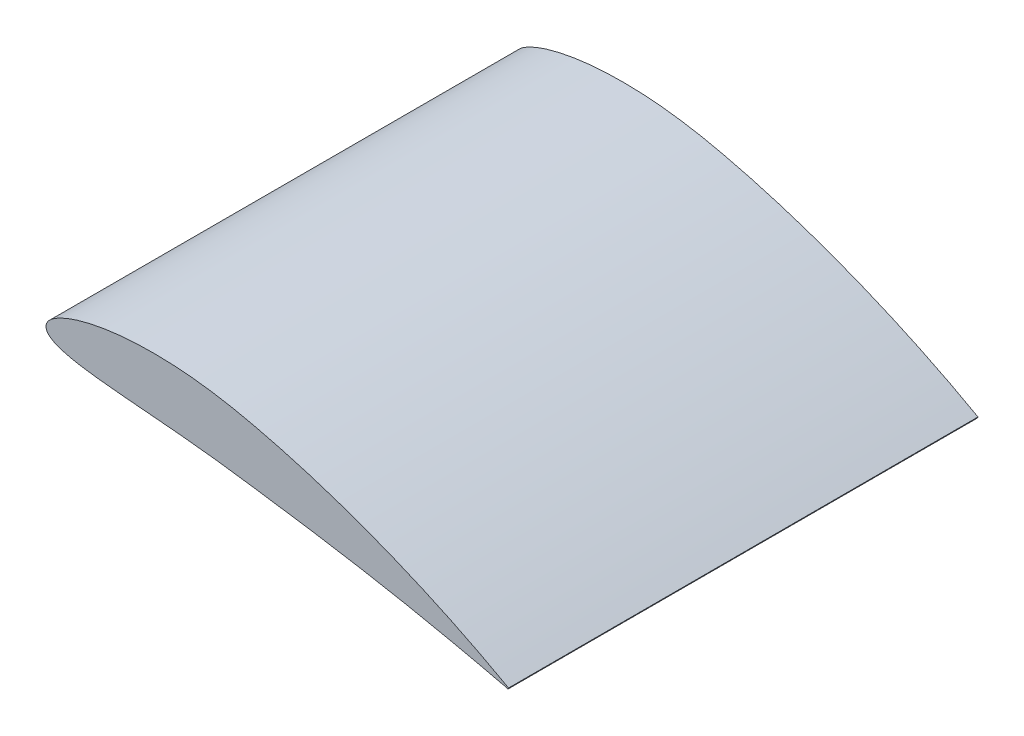
ISO-10303-21;
HEADER;
FILE_DESCRIPTION(('STEP AP214'),'2;1');
FILE_NAME('part.step','',(''),(''),'','','');
FILE_SCHEMA(('AUTOMOTIVE_DESIGN { 1 0 10303 214 1 1 1 1 }'));
ENDSEC;
DATA;
#1=APPLICATION_CONTEXT('core data for automotive mechanical design processes');
#2=APPLICATION_PROTOCOL_DEFINITION('international standard','automotive_design',2000,#1);
#3=PRODUCT_CONTEXT('',#1,'mechanical');
#4=PRODUCT('Part','Part','',(#3));
#5=PRODUCT_RELATED_PRODUCT_CATEGORY('part','',(#4));
#6=PRODUCT_DEFINITION_FORMATION('','',#4);
#7=PRODUCT_DEFINITION_CONTEXT('part definition',#1,'design');
#8=PRODUCT_DEFINITION('design','',#6,#7);
#9=PRODUCT_DEFINITION_SHAPE('','',#8);
#10=(LENGTH_UNIT() NAMED_UNIT(*) SI_UNIT(.MILLI.,.METRE.));
#11=(NAMED_UNIT(*) PLANE_ANGLE_UNIT() SI_UNIT($,.RADIAN.));
#12=(NAMED_UNIT(*) SI_UNIT($,.STERADIAN.) SOLID_ANGLE_UNIT());
#13=UNCERTAINTY_MEASURE_WITH_UNIT(LENGTH_MEASURE(1.E-05),#10,'distance_accuracy_value','');
#14=(GEOMETRIC_REPRESENTATION_CONTEXT(3) GLOBAL_UNCERTAINTY_ASSIGNED_CONTEXT((#13)) GLOBAL_UNIT_ASSIGNED_CONTEXT((#10,
#11,#12)) REPRESENTATION_CONTEXT('',''));
#15=CARTESIAN_POINT('',(0.,0.,0.));
#16=DIRECTION('',(0.,0.,1.));
#17=DIRECTION('',(1.,0.,0.));
#18=AXIS2_PLACEMENT_3D('',#15,#16,#17);
#19=CARTESIAN_POINT('',(0.985269278690768,-0.172470428097612,1.));
#20=CARTESIAN_POINT('',(0.984446031969574,-0.172013910129943,1.));
#21=CARTESIAN_POINT('',(0.981165968200391,-0.170195004561075,1.));
#22=CARTESIAN_POINT('',(0.973824529229477,-0.166118846994098,1.));
#23=CARTESIAN_POINT('',(0.961629350404027,-0.159480582421304,1.));
#24=CARTESIAN_POINT('',(0.936111695653137,-0.145769989488306,1.));
#25=CARTESIAN_POINT('',(0.89323054110287,-0.123701536460744,1.));
#26=CARTESIAN_POINT('',(0.843029009774551,-0.0996155048852169,1.));
#27=CARTESIAN_POINT('',(0.794907243015118,-0.0780049645763732,1.));
#28=CARTESIAN_POINT('',(0.738436664638583,-0.053969044922456,1.));
#29=CARTESIAN_POINT('',(0.678134153113778,-0.0304956174141789,1.));
#30=CARTESIAN_POINT('',(0.597797697452947,-0.00244599506510321,1.));
#31=CARTESIAN_POINT('',(0.530545327238815,0.0182290947521922,1.));
#32=CARTESIAN_POINT('',(0.462091411751428,0.0360789411045517,1.));
#33=CARTESIAN_POINT('',(0.410466522271251,0.0480338283675693,1.));
#34=CARTESIAN_POINT('',(0.359036754266365,0.05743796086664,1.));
#35=CARTESIAN_POINT('',(0.308451004926821,0.0637637393141408,1.));
#36=CARTESIAN_POINT('',(0.259794041074309,0.067079108138467,1.));
#37=CARTESIAN_POINT('',(0.213750756395059,0.0675740183502167,1.));
#38=CARTESIAN_POINT('',(0.170966814692538,0.0654673291053078,1.));
#39=CARTESIAN_POINT('',(0.132038367383088,0.0611250926597637,1.));
#40=CARTESIAN_POINT('',(0.097483945209041,0.0549581853960042,1.));
#41=CARTESIAN_POINT('',(0.0677376314760657,0.0473860910477904,1.));
#42=CARTESIAN_POINT('',(0.0431448163776546,0.0388417973321579,1.));
#43=CARTESIAN_POINT('',(0.0238827318536479,0.0297492310751248,1.));
#44=CARTESIAN_POINT('',(0.0100896059355207,0.0203555295229221,1.));
#45=CARTESIAN_POINT('',(0.00139878206729698,0.0106881834856044,1.));
#46=CARTESIAN_POINT('',(-0.00114309078928009,-0.00013579481166079,1.));
#47=CARTESIAN_POINT('',(0.00379302188114431,-0.0100369129163749,1.));
#48=CARTESIAN_POINT('',(0.0141866935060546,-0.01752454815321,1.));
#49=CARTESIAN_POINT('',(0.0291712783187127,-0.0238794149046508,1.));
#50=CARTESIAN_POINT('',(0.0489617937593607,-0.029314999722732,1.));
#51=CARTESIAN_POINT('',(0.0733217433648267,-0.033999897525832,1.));
#52=CARTESIAN_POINT('',(0.10198930900467,-0.0380516375467295,1.));
#53=CARTESIAN_POINT('',(0.134601478220816,-0.0416535727437438,1.));
#54=CARTESIAN_POINT('',(0.170783653035528,-0.0449938080693612,1.));
#55=CARTESIAN_POINT('',(0.210129627823403,-0.04834819293044,1.));
#56=CARTESIAN_POINT('',(0.267767766286934,-0.0532815256115667,1.));
#57=CARTESIAN_POINT('',(0.328259562873433,-0.0591043799187839,1.));
#58=CARTESIAN_POINT('',(0.391294981964109,-0.0669820784718382,1.));
#59=CARTESIAN_POINT('',(0.44095237658525,-0.0739887691693217,1.));
#60=CARTESIAN_POINT('',(0.491660204951425,-0.081126562043076,1.));
#61=CARTESIAN_POINT('',(0.559014769367733,-0.0910933210139359,1.));
#62=CARTESIAN_POINT('',(0.625350905341713,-0.101667664271665,1.));
#63=CARTESIAN_POINT('',(0.689911856826881,-0.112910425702524,1.));
#64=CARTESIAN_POINT('',(0.735595609692062,-0.121311528405815,1.));
#65=CARTESIAN_POINT('',(0.778690915477186,-0.129627802429058,1.));
#66=CARTESIAN_POINT('',(0.818703035108269,-0.137750140273152,1.));
#67=CARTESIAN_POINT('',(0.855192821369693,-0.145415083718065,1.));
#68=CARTESIAN_POINT('',(0.887744282998787,-0.15252928101685,1.));
#69=CARTESIAN_POINT('',(0.91593537457969,-0.158809255207468,1.));
#70=CARTESIAN_POINT('',(0.939589112098885,-0.164368839911153,1.));
#71=CARTESIAN_POINT('',(0.958007604752378,-0.168288914154116,1.));
#72=CARTESIAN_POINT('',(0.971988491946823,-0.172462524132999,1.));
#73=CARTESIAN_POINT('',(0.979243126779884,-0.172681643535203,1.));
#74=CARTESIAN_POINT('',(0.984333756401404,-0.175644292323673,1.));
#75=CARTESIAN_POINT('',(0.984695577532887,-0.174120575809229,1.));
#76=CARTESIAN_POINT('',(0.984807753012208,-0.173648177666931,1.));
#77=B_SPLINE_CURVE_WITH_KNOTS('',3,(#19,#20,#21,#22,#23,#24,#25,#26,#27,#28,#29,#30,#31,#32,#33,
#34,#35,#36,#37,#38,#39,#40,#41,#42,#43,#44,#45,#46,#47,#48,#49,#50,#51,#52,#53,#54,#55,#56,#57,
#58,#59,#60,#61,#62,#63,#64,#65,#66,#67,#68,#69,#70,#71,#72,#73,#74,#75,#76),.UNSPECIFIED.,.F.,
.F.,(4,1,1,1,1,1,1,1,1,1,1,1,1,1,1,1,1,1,1,1,1,1,1,1,1,1,1,1,1,1,1,1,1,1,1,1,1,1,1,1,1,1,1,1,1,
1,1,1,1,1,1,1,1,1,1,4),(0.,0.00137157662502608,0.00546477584250823,0.0122348018502246,
0.0216019692657692,0.0476712497544171,0.0824962611380079,0.102719148689264,0.124527079157664,
0.171912572572513,0.196978379588112,0.248496766675201,0.274385100810321,0.300041178316028,
0.325689987882079,0.350525087532111,0.374279703233646,0.39671125377608,0.41757673414408,
0.436654005915541,0.45374438973928,0.468679993939526,0.481329415272233,0.491630702034347,
0.499615788540128,0.50554628117804,0.510184984462959,0.514824193684277,0.520701508332397,
0.528516039729706,0.538465751713385,0.55054260931231,0.564643256443601,0.580638139182816,
0.598344876375769,0.617584458372554,0.638174400803704,0.682632113153432,0.706120665440723,
0.730727382957721,0.755700243562022,0.780731768779878,0.829932395841959,0.853570292180874,
0.876213105152017,0.897609986535304,0.917519393525195,0.935698347216139,0.951942678095033,
0.966047158851578,0.977839939974046,0.987174001699795,0.993931500880097,0.998018399437236,
0.999385643972647,1.),.UNSPECIFIED.);
#78=DIRECTION('',(0.,0.,-1.));
#79=VECTOR('',#78,1.);
#80=SURFACE_OF_LINEAR_EXTRUSION('',#77,#79);
#81=CARTESIAN_POINT('',(0.985269278690768,-0.172470428097612,0.));
#82=CARTESIAN_POINT('',(0.984446031969574,-0.172013910129943,0.));
#83=CARTESIAN_POINT('',(0.981165968200391,-0.170195004561075,0.));
#84=CARTESIAN_POINT('',(0.973824529229477,-0.166118846994098,0.));
#85=CARTESIAN_POINT('',(0.961629350404027,-0.159480582421304,0.));
#86=CARTESIAN_POINT('',(0.936111695653137,-0.145769989488306,0.));
#87=CARTESIAN_POINT('',(0.89323054110287,-0.123701536460744,0.));
#88=CARTESIAN_POINT('',(0.843029009774551,-0.0996155048852169,0.));
#89=CARTESIAN_POINT('',(0.794907243015118,-0.0780049645763732,0.));
#90=CARTESIAN_POINT('',(0.738436664638583,-0.053969044922456,0.));
#91=CARTESIAN_POINT('',(0.678134153113778,-0.0304956174141789,0.));
#92=CARTESIAN_POINT('',(0.597797697452947,-0.00244599506510321,0.));
#93=CARTESIAN_POINT('',(0.530545327238815,0.0182290947521922,0.));
#94=CARTESIAN_POINT('',(0.462091411751428,0.0360789411045517,0.));
#95=CARTESIAN_POINT('',(0.410466522271251,0.0480338283675693,0.));
#96=CARTESIAN_POINT('',(0.359036754266365,0.05743796086664,0.));
#97=CARTESIAN_POINT('',(0.308451004926821,0.0637637393141408,0.));
#98=CARTESIAN_POINT('',(0.259794041074309,0.067079108138467,0.));
#99=CARTESIAN_POINT('',(0.213750756395059,0.0675740183502167,0.));
#100=CARTESIAN_POINT('',(0.170966814692538,0.0654673291053078,0.));
#101=CARTESIAN_POINT('',(0.132038367383088,0.0611250926597637,0.));
#102=CARTESIAN_POINT('',(0.097483945209041,0.0549581853960042,0.));
#103=CARTESIAN_POINT('',(0.0677376314760657,0.0473860910477904,0.));
#104=CARTESIAN_POINT('',(0.0431448163776546,0.0388417973321579,0.));
#105=CARTESIAN_POINT('',(0.0238827318536479,0.0297492310751248,0.));
#106=CARTESIAN_POINT('',(0.0100896059355207,0.0203555295229221,0.));
#107=CARTESIAN_POINT('',(0.00139878206729698,0.0106881834856044,0.));
#108=CARTESIAN_POINT('',(-0.00114309078928009,-0.00013579481166079,0.));
#109=CARTESIAN_POINT('',(0.00379302188114431,-0.0100369129163749,0.));
#110=CARTESIAN_POINT('',(0.0141866935060546,-0.01752454815321,0.));
#111=CARTESIAN_POINT('',(0.0291712783187127,-0.0238794149046508,0.));
#112=CARTESIAN_POINT('',(0.0489617937593607,-0.029314999722732,0.));
#113=CARTESIAN_POINT('',(0.0733217433648267,-0.033999897525832,0.));
#114=CARTESIAN_POINT('',(0.10198930900467,-0.0380516375467295,0.));
#115=CARTESIAN_POINT('',(0.134601478220816,-0.0416535727437438,0.));
#116=CARTESIAN_POINT('',(0.170783653035528,-0.0449938080693612,0.));
#117=CARTESIAN_POINT('',(0.210129627823403,-0.04834819293044,0.));
#118=CARTESIAN_POINT('',(0.267767766286934,-0.0532815256115667,0.));
#119=CARTESIAN_POINT('',(0.328259562873433,-0.0591043799187839,0.));
#120=CARTESIAN_POINT('',(0.391294981964109,-0.0669820784718382,0.));
#121=CARTESIAN_POINT('',(0.44095237658525,-0.0739887691693217,0.));
#122=CARTESIAN_POINT('',(0.491660204951425,-0.081126562043076,0.));
#123=CARTESIAN_POINT('',(0.559014769367733,-0.0910933210139359,0.));
#124=CARTESIAN_POINT('',(0.625350905341713,-0.101667664271665,0.));
#125=CARTESIAN_POINT('',(0.689911856826881,-0.112910425702524,0.));
#126=CARTESIAN_POINT('',(0.735595609692062,-0.121311528405815,0.));
#127=CARTESIAN_POINT('',(0.778690915477186,-0.129627802429058,0.));
#128=CARTESIAN_POINT('',(0.818703035108269,-0.137750140273152,0.));
#129=CARTESIAN_POINT('',(0.855192821369693,-0.145415083718065,0.));
#130=CARTESIAN_POINT('',(0.887744282998787,-0.15252928101685,0.));
#131=CARTESIAN_POINT('',(0.91593537457969,-0.158809255207468,0.));
#132=CARTESIAN_POINT('',(0.939589112098885,-0.164368839911153,0.));
#133=CARTESIAN_POINT('',(0.958007604752378,-0.168288914154116,0.));
#134=CARTESIAN_POINT('',(0.971988491946823,-0.172462524132999,0.));
#135=CARTESIAN_POINT('',(0.979243126779884,-0.172681643535203,0.));
#136=CARTESIAN_POINT('',(0.984333756401404,-0.175644292323673,0.));
#137=CARTESIAN_POINT('',(0.984695577532887,-0.174120575809229,0.));
#138=CARTESIAN_POINT('',(0.984807753012208,-0.173648177666931,0.));
#139=B_SPLINE_CURVE_WITH_KNOTS('',3,(#81,#82,#83,#84,#85,#86,#87,#88,#89,#90,#91,#92,#93,#94,
#95,#96,#97,#98,#99,#100,#101,#102,#103,#104,#105,#106,#107,#108,#109,#110,#111,#112,#113,#114,
#115,#116,#117,#118,#119,#120,#121,#122,#123,#124,#125,#126,#127,#128,#129,#130,#131,#132,#133,
#134,#135,#136,#137,#138),.UNSPECIFIED.,.F.,.F.,(4,1,1,1,1,1,1,1,1,1,1,1,1,1,1,1,1,1,1,1,1,1,1,
1,1,1,1,1,1,1,1,1,1,1,1,1,1,1,1,1,1,1,1,1,1,1,1,1,1,1,1,1,1,1,1,4),(0.,0.00137157662502608,
0.00546477584250823,0.0122348018502246,0.0216019692657692,0.0476712497544171,0.0824962611380079,
0.102719148689264,0.124527079157664,0.171912572572513,0.196978379588112,0.248496766675201,
0.274385100810321,0.300041178316028,0.325689987882079,0.350525087532111,0.374279703233646,
0.39671125377608,0.41757673414408,0.436654005915541,0.45374438973928,0.468679993939526,
0.481329415272233,0.491630702034347,0.499615788540128,0.50554628117804,0.510184984462959,
0.514824193684277,0.520701508332397,0.528516039729706,0.538465751713385,0.55054260931231,
0.564643256443601,0.580638139182816,0.598344876375769,0.617584458372554,0.638174400803704,
0.682632113153432,0.706120665440723,0.730727382957721,0.755700243562022,0.780731768779878,
0.829932395841959,0.853570292180874,0.876213105152017,0.897609986535304,0.917519393525195,
0.935698347216139,0.951942678095033,0.966047158851578,0.977839939974046,0.987174001699795,
0.993931500880097,0.998018399437236,0.999385643972647,1.),.UNSPECIFIED.);
#140=CARTESIAN_POINT('',(0.985269278690768,-0.172470428097612,0.));
#141=VERTEX_POINT('',#140);
#142=CARTESIAN_POINT('',(0.984807753012208,-0.173648177666931,0.));
#143=VERTEX_POINT('',#142);
#144=EDGE_CURVE('E69',#141,#143,#139,.T.);
#145=ORIENTED_EDGE('',*,*,#144,.T.);
#146=DIRECTION('',(0.,0.,-1.));
#147=VECTOR('',#146,1.);
#148=CARTESIAN_POINT('',(0.984807753012208,-0.173648177666931,1.));
#149=LINE('',#148,#147);
#150=CARTESIAN_POINT('',(0.984807753012208,-0.173648177666931,1.));
#151=VERTEX_POINT('',#150);
#152=EDGE_CURVE('E11',#151,#143,#149,.T.);
#153=ORIENTED_EDGE('',*,*,#152,.F.);
#154=CARTESIAN_POINT('',(0.985269278690768,-0.172470428097612,1.));
#155=VERTEX_POINT('',#154);
#156=EDGE_CURVE('E68',#155,#151,#77,.T.);
#157=ORIENTED_EDGE('',*,*,#156,.F.);
#158=DIRECTION('',(0.,0.,-1.));
#159=VECTOR('',#158,1.);
#160=CARTESIAN_POINT('',(0.985269278690768,-0.172470428097612,1.));
#161=LINE('',#160,#159);
#162=EDGE_CURVE('E46',#155,#141,#161,.T.);
#163=ORIENTED_EDGE('',*,*,#162,.T.);
#164=EDGE_LOOP('',(#145,#153,#157,#163));
#165=FACE_BOUND('',#164,.T.);
#166=ADVANCED_FACE('F37',(#165),#80,.F.);
#167=CARTESIAN_POINT('',(0.985269278690768,-0.172470428097612,1.));
#168=DIRECTION('',(-0.93106369279625,0.364856684133112,0.));
#169=DIRECTION('',(-0.364856684133112,-0.93106369279625,0.));
#170=AXIS2_PLACEMENT_3D('',#167,#168,#169);
#171=PLANE('',#170);
#172=DIRECTION('',(0.364856684133112,0.93106369279625,0.));
#173=VECTOR('',#172,1.);
#174=CARTESIAN_POINT('',(0.985269278690768,-0.172470428097612,0.));
#175=LINE('',#174,#173);
#176=EDGE_CURVE('E61',#143,#141,#175,.T.);
#177=ORIENTED_EDGE('',*,*,#176,.T.);
#178=ORIENTED_EDGE('',*,*,#162,.F.);
#179=DIRECTION('',(0.364856684133112,0.93106369279625,0.));
#180=VECTOR('',#179,1.);
#181=CARTESIAN_POINT('',(0.985269278690768,-0.172470428097612,1.));
#182=LINE('',#181,#180);
#183=EDGE_CURVE('E53',#151,#155,#182,.T.);
#184=ORIENTED_EDGE('',*,*,#183,.F.);
#185=ORIENTED_EDGE('',*,*,#152,.T.);
#186=EDGE_LOOP('',(#177,#178,#184,#185));
#187=FACE_BOUND('',#186,.T.);
#188=ADVANCED_FACE('F64',(#187),#171,.F.);
#189=CARTESIAN_POINT('',(0.00879676064678333,0.0184090646908765,1.));
#190=DIRECTION('',(0.,0.,-1.));
#191=DIRECTION('',(-1.,0.,0.));
#192=AXIS2_PLACEMENT_3D('',#189,#190,#191);
#193=PLANE('',#192);
#194=ORIENTED_EDGE('',*,*,#156,.T.);
#195=ORIENTED_EDGE('',*,*,#183,.T.);
#196=EDGE_LOOP('',(#194,#195));
#197=FACE_BOUND('',#196,.T.);
#198=ADVANCED_FACE('F86',(#197),#193,.F.);
#199=CARTESIAN_POINT('',(0.00879676064678333,0.0184090646908765,0.));
#200=DIRECTION('',(0.,0.,-1.));
#201=DIRECTION('',(-1.,0.,0.));
#202=AXIS2_PLACEMENT_3D('',#199,#200,#201);
#203=PLANE('',#202);
#204=ORIENTED_EDGE('',*,*,#144,.F.);
#205=ORIENTED_EDGE('',*,*,#176,.F.);
#206=EDGE_LOOP('',(#204,#205));
#207=FACE_BOUND('',#206,.T.);
#208=ADVANCED_FACE('F72',(#207),#203,.T.);
#209=CLOSED_SHELL('',(#166,#188,#198,#208));
#210=MANIFOLD_SOLID_BREP('B2',#209);
#211=ADVANCED_BREP_SHAPE_REPRESENTATION('',(#18,#210),#14);
#212=SHAPE_DEFINITION_REPRESENTATION(#9,#211);
ENDSEC;
END-ISO-10303-21;
